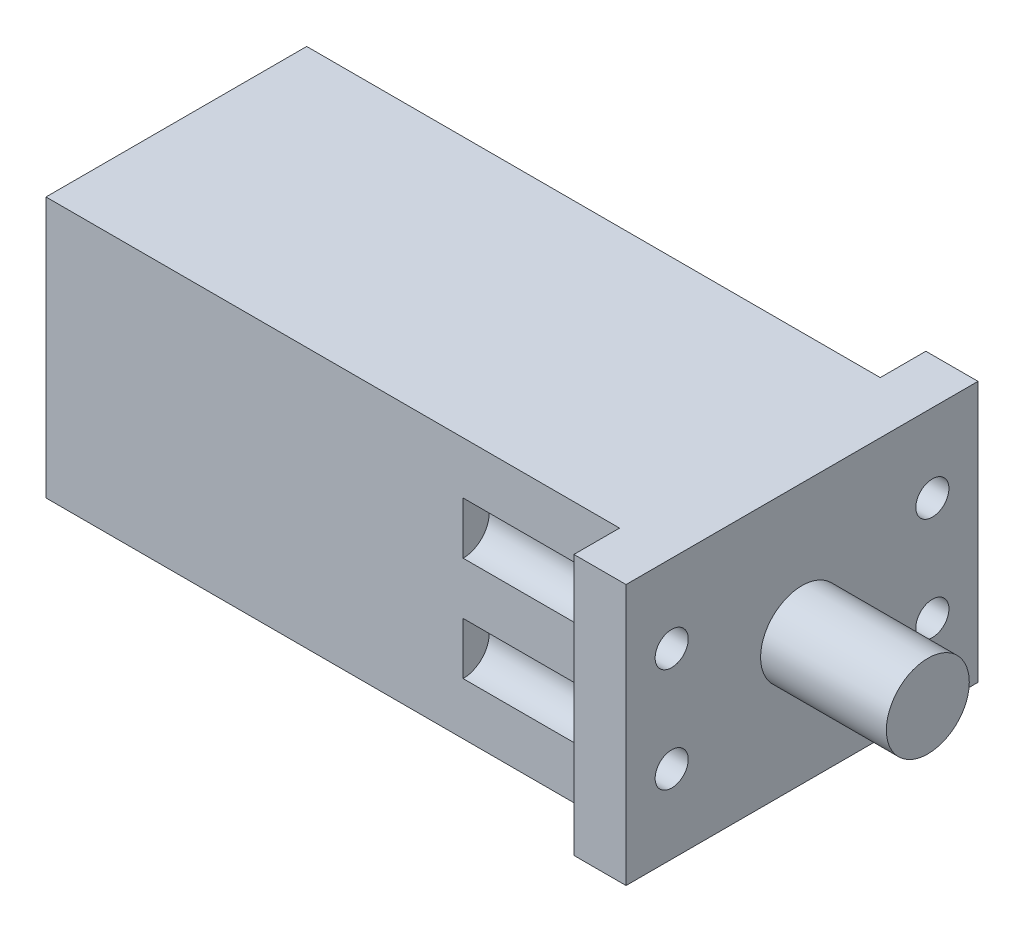
ISO-10303-21;
HEADER;
FILE_DESCRIPTION(('STEP AP214'),'2;1');
FILE_NAME('part.step','',(''),(''),'','','');
FILE_SCHEMA(('AUTOMOTIVE_DESIGN { 1 0 10303 214 1 1 1 1 }'));
ENDSEC;
DATA;
#1=APPLICATION_CONTEXT('core data for automotive mechanical design processes');
#2=APPLICATION_PROTOCOL_DEFINITION('international standard','automotive_design',2000,#1);
#3=PRODUCT_CONTEXT('',#1,'mechanical');
#4=PRODUCT('Part','Part','',(#3));
#5=PRODUCT_RELATED_PRODUCT_CATEGORY('part','',(#4));
#6=PRODUCT_DEFINITION_FORMATION('','',#4);
#7=PRODUCT_DEFINITION_CONTEXT('part definition',#1,'design');
#8=PRODUCT_DEFINITION('design','',#6,#7);
#9=PRODUCT_DEFINITION_SHAPE('','',#8);
#10=(LENGTH_UNIT() NAMED_UNIT(*) SI_UNIT(.MILLI.,.METRE.));
#11=(NAMED_UNIT(*) PLANE_ANGLE_UNIT() SI_UNIT($,.RADIAN.));
#12=(NAMED_UNIT(*) SI_UNIT($,.STERADIAN.) SOLID_ANGLE_UNIT());
#13=UNCERTAINTY_MEASURE_WITH_UNIT(LENGTH_MEASURE(1.E-05),#10,'distance_accuracy_value','');
#14=(GEOMETRIC_REPRESENTATION_CONTEXT(3) GLOBAL_UNCERTAINTY_ASSIGNED_CONTEXT((#13)) GLOBAL_UNIT_ASSIGNED_CONTEXT((#10,
#11,#12)) REPRESENTATION_CONTEXT('',''));
#15=CARTESIAN_POINT('',(0.,0.,0.));
#16=DIRECTION('',(0.,0.,1.));
#17=DIRECTION('',(1.,0.,0.));
#18=AXIS2_PLACEMENT_3D('',#15,#16,#17);
#19=CARTESIAN_POINT('',(240.,0.,-100.));
#20=DIRECTION('',(0.,0.,1.));
#21=DIRECTION('',(1.,0.,0.));
#22=AXIS2_PLACEMENT_3D('',#19,#20,#21);
#23=PLANE('',#22);
#24=DIRECTION('',(1.,0.,0.));
#25=VECTOR('',#24,1.);
#26=CARTESIAN_POINT('',(160.,20.,-100.));
#27=LINE('',#26,#25);
#28=CARTESIAN_POINT('',(220.,20.,-100.));
#29=VERTEX_POINT('',#28);
#30=CARTESIAN_POINT('',(160.,20.,-100.));
#31=VERTEX_POINT('',#30);
#32=EDGE_CURVE('E153',#29,#31,#27,.F.);
#33=ORIENTED_EDGE('',*,*,#32,.F.);
#34=DIRECTION('',(0.,1.,0.));
#35=VECTOR('',#34,1.);
#36=CARTESIAN_POINT('',(220.,0.,-100.));
#37=LINE('',#36,#35);
#38=CARTESIAN_POINT('',(220.,0.,-100.));
#39=VERTEX_POINT('',#38);
#40=EDGE_CURVE('E46',#39,#29,#37,.T.);
#41=ORIENTED_EDGE('',*,*,#40,.F.);
#42=DIRECTION('',(-1.,0.,0.));
#43=VECTOR('',#42,1.);
#44=CARTESIAN_POINT('',(240.,0.,-100.));
#45=LINE('',#44,#43);
#46=CARTESIAN_POINT('',(0.,0.,-100.));
#47=VERTEX_POINT('',#46);
#48=EDGE_CURVE('E324',#39,#47,#45,.T.);
#49=ORIENTED_EDGE('',*,*,#48,.T.);
#50=DIRECTION('',(0.,1.,0.));
#51=VECTOR('',#50,1.);
#52=CARTESIAN_POINT('',(0.,0.,-100.));
#53=LINE('',#52,#51);
#54=CARTESIAN_POINT('',(0.,100.,-100.));
#55=VERTEX_POINT('',#54);
#56=EDGE_CURVE('E330',#47,#55,#53,.T.);
#57=ORIENTED_EDGE('',*,*,#56,.T.);
#58=DIRECTION('',(-1.,0.,0.));
#59=VECTOR('',#58,1.);
#60=CARTESIAN_POINT('',(240.,100.,-100.));
#61=LINE('',#60,#59);
#62=CARTESIAN_POINT('',(220.,100.,-100.));
#63=VERTEX_POINT('',#62);
#64=EDGE_CURVE('E348',#63,#55,#61,.T.);
#65=ORIENTED_EDGE('',*,*,#64,.F.);
#66=CARTESIAN_POINT('',(220.,80.,-100.));
#67=VERTEX_POINT('',#66);
#68=EDGE_CURVE('E166',#67,#63,#37,.T.);
#69=ORIENTED_EDGE('',*,*,#68,.F.);
#70=DIRECTION('',(1.,0.,0.));
#71=VECTOR('',#70,1.);
#72=CARTESIAN_POINT('',(160.,80.,-100.));
#73=LINE('',#72,#71);
#74=CARTESIAN_POINT('',(160.,80.,-100.));
#75=VERTEX_POINT('',#74);
#76=EDGE_CURVE('E279',#75,#67,#73,.T.);
#77=ORIENTED_EDGE('',*,*,#76,.F.);
#78=DIRECTION('',(0.,-1.,0.));
#79=VECTOR('',#78,1.);
#80=CARTESIAN_POINT('',(160.,0.,-100.));
#81=LINE('',#80,#79);
#82=CARTESIAN_POINT('',(160.,60.,-100.));
#83=VERTEX_POINT('',#82);
#84=EDGE_CURVE('E39',#75,#83,#81,.T.);
#85=ORIENTED_EDGE('',*,*,#84,.T.);
#86=DIRECTION('',(1.,0.,0.));
#87=VECTOR('',#86,1.);
#88=CARTESIAN_POINT('',(160.,60.,-100.));
#89=LINE('',#88,#87);
#90=CARTESIAN_POINT('',(220.,60.,-100.));
#91=VERTEX_POINT('',#90);
#92=EDGE_CURVE('E165',#91,#83,#89,.F.);
#93=ORIENTED_EDGE('',*,*,#92,.F.);
#94=CARTESIAN_POINT('',(220.,40.,-100.));
#95=VERTEX_POINT('',#94);
#96=EDGE_CURVE('E159',#95,#91,#37,.T.);
#97=ORIENTED_EDGE('',*,*,#96,.F.);
#98=DIRECTION('',(1.,0.,0.));
#99=VECTOR('',#98,1.);
#100=CARTESIAN_POINT('',(160.,40.,-100.));
#101=LINE('',#100,#99);
#102=CARTESIAN_POINT('',(160.,40.,-100.));
#103=VERTEX_POINT('',#102);
#104=EDGE_CURVE('E146',#103,#95,#101,.T.);
#105=ORIENTED_EDGE('',*,*,#104,.F.);
#106=DIRECTION('',(0.,-1.,0.));
#107=VECTOR('',#106,1.);
#108=CARTESIAN_POINT('',(160.,0.,-100.));
#109=LINE('',#108,#107);
#110=EDGE_CURVE('E11',#103,#31,#109,.T.);
#111=ORIENTED_EDGE('',*,*,#110,.T.);
#112=EDGE_LOOP('',(#33,#41,#49,#57,#65,#69,#77,#85,#93,#97,#105,#111));
#113=FACE_BOUND('',#112,.T.);
#114=ADVANCED_FACE('F31',(#113),#23,.F.);
#115=CARTESIAN_POINT('',(240.,0.,0.));
#116=DIRECTION('',(0.,0.,-1.));
#117=DIRECTION('',(-1.,0.,0.));
#118=AXIS2_PLACEMENT_3D('',#115,#116,#117);
#119=PLANE('',#118);
#120=DIRECTION('',(1.,0.,0.));
#121=VECTOR('',#120,1.);
#122=CARTESIAN_POINT('',(160.,40.,0.));
#123=LINE('',#122,#121);
#124=CARTESIAN_POINT('',(220.,40.,0.));
#125=VERTEX_POINT('',#124);
#126=CARTESIAN_POINT('',(160.,40.,0.));
#127=VERTEX_POINT('',#126);
#128=EDGE_CURVE('E266',#125,#127,#123,.F.);
#129=ORIENTED_EDGE('',*,*,#128,.F.);
#130=DIRECTION('',(0.,-1.,0.));
#131=VECTOR('',#130,1.);
#132=CARTESIAN_POINT('',(220.,0.,0.));
#133=LINE('',#132,#131);
#134=CARTESIAN_POINT('',(220.,60.,0.));
#135=VERTEX_POINT('',#134);
#136=EDGE_CURVE('E192',#135,#125,#133,.T.);
#137=ORIENTED_EDGE('',*,*,#136,.F.);
#138=DIRECTION('',(1.,0.,0.));
#139=VECTOR('',#138,1.);
#140=CARTESIAN_POINT('',(160.,60.,0.));
#141=LINE('',#140,#139);
#142=CARTESIAN_POINT('',(160.,60.,0.));
#143=VERTEX_POINT('',#142);
#144=EDGE_CURVE('E260',#143,#135,#141,.T.);
#145=ORIENTED_EDGE('',*,*,#144,.F.);
#146=DIRECTION('',(0.,1.,0.));
#147=VECTOR('',#146,1.);
#148=CARTESIAN_POINT('',(160.,0.,0.));
#149=LINE('',#148,#147);
#150=CARTESIAN_POINT('',(160.,80.,0.));
#151=VERTEX_POINT('',#150);
#152=EDGE_CURVE('E188',#143,#151,#149,.T.);
#153=ORIENTED_EDGE('',*,*,#152,.T.);
#154=DIRECTION('',(1.,0.,0.));
#155=VECTOR('',#154,1.);
#156=CARTESIAN_POINT('',(160.,80.,0.));
#157=LINE('',#156,#155);
#158=CARTESIAN_POINT('',(220.,80.,0.));
#159=VERTEX_POINT('',#158);
#160=EDGE_CURVE('E258',#159,#151,#157,.F.);
#161=ORIENTED_EDGE('',*,*,#160,.F.);
#162=CARTESIAN_POINT('',(220.,100.,0.));
#163=VERTEX_POINT('',#162);
#164=EDGE_CURVE('E54',#163,#159,#133,.T.);
#165=ORIENTED_EDGE('',*,*,#164,.F.);
#166=DIRECTION('',(-1.,0.,0.));
#167=VECTOR('',#166,1.);
#168=CARTESIAN_POINT('',(240.,100.,0.));
#169=LINE('',#168,#167);
#170=CARTESIAN_POINT('',(0.,100.,0.));
#171=VERTEX_POINT('',#170);
#172=EDGE_CURVE('E346',#163,#171,#169,.T.);
#173=ORIENTED_EDGE('',*,*,#172,.T.);
#174=DIRECTION('',(0.,-1.,0.));
#175=VECTOR('',#174,1.);
#176=CARTESIAN_POINT('',(0.,0.,0.));
#177=LINE('',#176,#175);
#178=CARTESIAN_POINT('',(0.,0.,0.));
#179=VERTEX_POINT('',#178);
#180=EDGE_CURVE('E331',#171,#179,#177,.T.);
#181=ORIENTED_EDGE('',*,*,#180,.T.);
#182=DIRECTION('',(-1.,0.,0.));
#183=VECTOR('',#182,1.);
#184=CARTESIAN_POINT('',(240.,0.,0.));
#185=LINE('',#184,#183);
#186=CARTESIAN_POINT('',(220.,0.,0.));
#187=VERTEX_POINT('',#186);
#188=EDGE_CURVE('E218',#187,#179,#185,.T.);
#189=ORIENTED_EDGE('',*,*,#188,.F.);
#190=CARTESIAN_POINT('',(220.,20.,0.));
#191=VERTEX_POINT('',#190);
#192=EDGE_CURVE('E189',#191,#187,#133,.T.);
#193=ORIENTED_EDGE('',*,*,#192,.F.);
#194=DIRECTION('',(1.,0.,0.));
#195=VECTOR('',#194,1.);
#196=CARTESIAN_POINT('',(160.,20.,0.));
#197=LINE('',#196,#195);
#198=CARTESIAN_POINT('',(160.,20.,0.));
#199=VERTEX_POINT('',#198);
#200=EDGE_CURVE('E270',#199,#191,#197,.T.);
#201=ORIENTED_EDGE('',*,*,#200,.F.);
#202=DIRECTION('',(0.,1.,0.));
#203=VECTOR('',#202,1.);
#204=CARTESIAN_POINT('',(160.,0.,0.));
#205=LINE('',#204,#203);
#206=EDGE_CURVE('E185',#199,#127,#205,.T.);
#207=ORIENTED_EDGE('',*,*,#206,.T.);
#208=EDGE_LOOP('',(#129,#137,#145,#153,#161,#165,#173,#181,#189,#193,#201,#207));
#209=FACE_BOUND('',#208,.T.);
#210=ADVANCED_FACE('F33',(#209),#119,.F.);
#211=CARTESIAN_POINT('',(240.,100.,0.));
#212=DIRECTION('',(-1.,0.,0.));
#213=DIRECTION('',(0.,0.,1.));
#214=AXIS2_PLACEMENT_3D('',#211,#212,#213);
#215=PLANE('',#214);
#216=CARTESIAN_POINT('',(240.,70.,-100.));
#217=DIRECTION('',(1.,0.,0.));
#218=DIRECTION('',(0.,0.,-1.));
#219=AXIS2_PLACEMENT_3D('',#216,#217,#218);
#220=CIRCLE('',#219,6.34999999999999);
#221=CARTESIAN_POINT('',(240.,70.,-106.35));
#222=VERTEX_POINT('',#221);
#223=EDGE_CURVE('E255',#222,#222,#220,.T.);
#224=ORIENTED_EDGE('',*,*,#223,.F.);
#225=EDGE_LOOP('',(#224));
#226=FACE_BOUND('',#225,.T.);
#227=CARTESIAN_POINT('',(240.,30.,-100.));
#228=DIRECTION('',(1.,0.,0.));
#229=DIRECTION('',(0.,0.,-1.));
#230=AXIS2_PLACEMENT_3D('',#227,#228,#229);
#231=CIRCLE('',#230,6.35);
#232=CARTESIAN_POINT('',(240.,30.,-106.35));
#233=VERTEX_POINT('',#232);
#234=EDGE_CURVE('E250',#233,#233,#231,.T.);
#235=ORIENTED_EDGE('',*,*,#234,.F.);
#236=EDGE_LOOP('',(#235));
#237=FACE_BOUND('',#236,.T.);
#238=CARTESIAN_POINT('',(240.,30.,0.));
#239=DIRECTION('',(1.,0.,0.));
#240=DIRECTION('',(0.,0.,-1.));
#241=AXIS2_PLACEMENT_3D('',#238,#239,#240);
#242=CIRCLE('',#241,6.35);
#243=CARTESIAN_POINT('',(240.,30.,-6.35));
#244=VERTEX_POINT('',#243);
#245=EDGE_CURVE('E247',#244,#244,#242,.T.);
#246=ORIENTED_EDGE('',*,*,#245,.F.);
#247=EDGE_LOOP('',(#246));
#248=FACE_BOUND('',#247,.T.);
#249=CARTESIAN_POINT('',(240.,70.,0.));
#250=DIRECTION('',(1.,0.,0.));
#251=DIRECTION('',(0.,0.,-1.));
#252=AXIS2_PLACEMENT_3D('',#249,#250,#251);
#253=CIRCLE('',#252,6.35);
#254=CARTESIAN_POINT('',(240.,70.,-6.34999999999999));
#255=VERTEX_POINT('',#254);
#256=EDGE_CURVE('E241',#255,#255,#253,.T.);
#257=ORIENTED_EDGE('',*,*,#256,.F.);
#258=EDGE_LOOP('',(#257));
#259=FACE_BOUND('',#258,.T.);
#260=DIRECTION('',(0.,0.,1.));
#261=VECTOR('',#260,1.);
#262=CARTESIAN_POINT('',(240.,100.,0.));
#263=LINE('',#262,#261);
#264=CARTESIAN_POINT('',(240.,100.,-117.5));
#265=VERTEX_POINT('',#264);
#266=CARTESIAN_POINT('',(240.,100.,17.5));
#267=VERTEX_POINT('',#266);
#268=EDGE_CURVE('E349',#265,#267,#263,.T.);
#269=ORIENTED_EDGE('',*,*,#268,.T.);
#270=DIRECTION('',(0.,1.,0.));
#271=VECTOR('',#270,1.);
#272=CARTESIAN_POINT('',(240.,0.,17.5));
#273=LINE('',#272,#271);
#274=CARTESIAN_POINT('',(240.,0.,17.5));
#275=VERTEX_POINT('',#274);
#276=EDGE_CURVE('E178',#275,#267,#273,.T.);
#277=ORIENTED_EDGE('',*,*,#276,.F.);
#278=DIRECTION('',(0.,0.,-1.));
#279=VECTOR('',#278,1.);
#280=CARTESIAN_POINT('',(240.,0.,0.));
#281=LINE('',#280,#279);
#282=CARTESIAN_POINT('',(240.,0.,-117.5));
#283=VERTEX_POINT('',#282);
#284=EDGE_CURVE('E200',#275,#283,#281,.T.);
#285=ORIENTED_EDGE('',*,*,#284,.T.);
#286=DIRECTION('',(0.,-1.,0.));
#287=VECTOR('',#286,1.);
#288=CARTESIAN_POINT('',(240.,0.,-117.5));
#289=LINE('',#288,#287);
#290=EDGE_CURVE('E167',#265,#283,#289,.T.);
#291=ORIENTED_EDGE('',*,*,#290,.F.);
#292=EDGE_LOOP('',(#269,#277,#285,#291));
#293=FACE_BOUND('',#292,.T.);
#294=CARTESIAN_POINT('',(240.,50.,-50.));
#295=DIRECTION('',(-1.,0.,0.));
#296=DIRECTION('',(0.,0.,1.));
#297=AXIS2_PLACEMENT_3D('',#294,#295,#296);
#298=CIRCLE('',#297,15.9);
#299=CARTESIAN_POINT('',(240.,50.,-34.1));
#300=VERTEX_POINT('',#299);
#301=EDGE_CURVE('E215',#300,#300,#298,.F.);
#302=ORIENTED_EDGE('',*,*,#301,.F.);
#303=EDGE_LOOP('',(#302));
#304=FACE_BOUND('',#303,.T.);
#305=ADVANCED_FACE('F306',(#226,#237,#248,#259,#293,#304),#215,.F.);
#306=CARTESIAN_POINT('',(240.,0.,0.));
#307=DIRECTION('',(0.,1.,0.));
#308=DIRECTION('',(0.,0.,1.));
#309=AXIS2_PLACEMENT_3D('',#306,#307,#308);
#310=PLANE('',#309);
#311=DIRECTION('',(0.,0.,-1.));
#312=VECTOR('',#311,1.);
#313=CARTESIAN_POINT('',(0.,0.,0.));
#314=LINE('',#313,#312);
#315=EDGE_CURVE('E321',#179,#47,#314,.T.);
#316=ORIENTED_EDGE('',*,*,#315,.T.);
#317=ORIENTED_EDGE('',*,*,#48,.F.);
#318=DIRECTION('',(0.,0.,1.));
#319=VECTOR('',#318,1.);
#320=CARTESIAN_POINT('',(220.,0.,-117.5));
#321=LINE('',#320,#319);
#322=CARTESIAN_POINT('',(220.,0.,-117.5));
#323=VERTEX_POINT('',#322);
#324=EDGE_CURVE('E193',#323,#39,#321,.T.);
#325=ORIENTED_EDGE('',*,*,#324,.F.);
#326=DIRECTION('',(-1.,0.,0.));
#327=VECTOR('',#326,1.);
#328=CARTESIAN_POINT('',(240.,0.,-117.5));
#329=LINE('',#328,#327);
#330=EDGE_CURVE('E233',#283,#323,#329,.T.);
#331=ORIENTED_EDGE('',*,*,#330,.F.);
#332=ORIENTED_EDGE('',*,*,#284,.F.);
#333=DIRECTION('',(1.,0.,0.));
#334=VECTOR('',#333,1.);
#335=CARTESIAN_POINT('',(240.,0.,17.5));
#336=LINE('',#335,#334);
#337=CARTESIAN_POINT('',(220.,0.,17.5));
#338=VERTEX_POINT('',#337);
#339=EDGE_CURVE('E198',#338,#275,#336,.T.);
#340=ORIENTED_EDGE('',*,*,#339,.F.);
#341=DIRECTION('',(0.,0.,-1.));
#342=VECTOR('',#341,1.);
#343=CARTESIAN_POINT('',(220.,0.,17.5));
#344=LINE('',#343,#342);
#345=EDGE_CURVE('E360',#338,#187,#344,.T.);
#346=ORIENTED_EDGE('',*,*,#345,.T.);
#347=ORIENTED_EDGE('',*,*,#188,.T.);
#348=EDGE_LOOP('',(#316,#317,#325,#331,#332,#340,#346,#347));
#349=FACE_BOUND('',#348,.T.);
#350=ADVANCED_FACE('F310',(#349),#310,.F.);
#351=CARTESIAN_POINT('',(240.,100.,0.));
#352=DIRECTION('',(0.,-1.,0.));
#353=DIRECTION('',(0.,0.,-1.));
#354=AXIS2_PLACEMENT_3D('',#351,#352,#353);
#355=PLANE('',#354);
#356=DIRECTION('',(0.,0.,1.));
#357=VECTOR('',#356,1.);
#358=CARTESIAN_POINT('',(0.,100.,0.));
#359=LINE('',#358,#357);
#360=EDGE_CURVE('E336',#55,#171,#359,.T.);
#361=ORIENTED_EDGE('',*,*,#360,.T.);
#362=ORIENTED_EDGE('',*,*,#172,.F.);
#363=DIRECTION('',(0.,0.,-1.));
#364=VECTOR('',#363,1.);
#365=CARTESIAN_POINT('',(220.,100.,17.5));
#366=LINE('',#365,#364);
#367=CARTESIAN_POINT('',(220.,100.,17.5));
#368=VERTEX_POINT('',#367);
#369=EDGE_CURVE('E357',#368,#163,#366,.T.);
#370=ORIENTED_EDGE('',*,*,#369,.F.);
#371=DIRECTION('',(-1.,0.,0.));
#372=VECTOR('',#371,1.);
#373=CARTESIAN_POINT('',(240.,100.,17.5));
#374=LINE('',#373,#372);
#375=EDGE_CURVE('E369',#267,#368,#374,.T.);
#376=ORIENTED_EDGE('',*,*,#375,.F.);
#377=ORIENTED_EDGE('',*,*,#268,.F.);
#378=DIRECTION('',(1.,0.,0.));
#379=VECTOR('',#378,1.);
#380=CARTESIAN_POINT('',(240.,100.,-117.5));
#381=LINE('',#380,#379);
#382=CARTESIAN_POINT('',(220.,100.,-117.5));
#383=VERTEX_POINT('',#382);
#384=EDGE_CURVE('E176',#383,#265,#381,.T.);
#385=ORIENTED_EDGE('',*,*,#384,.F.);
#386=DIRECTION('',(0.,0.,1.));
#387=VECTOR('',#386,1.);
#388=CARTESIAN_POINT('',(220.,100.,-117.5));
#389=LINE('',#388,#387);
#390=EDGE_CURVE('E222',#383,#63,#389,.T.);
#391=ORIENTED_EDGE('',*,*,#390,.T.);
#392=ORIENTED_EDGE('',*,*,#64,.T.);
#393=EDGE_LOOP('',(#361,#362,#370,#376,#377,#385,#391,#392));
#394=FACE_BOUND('',#393,.T.);
#395=ADVANCED_FACE('F308',(#394),#355,.F.);
#396=CARTESIAN_POINT('',(0.,100.,0.));
#397=DIRECTION('',(-1.,0.,0.));
#398=DIRECTION('',(0.,0.,1.));
#399=AXIS2_PLACEMENT_3D('',#396,#397,#398);
#400=PLANE('',#399);
#401=ORIENTED_EDGE('',*,*,#180,.F.);
#402=ORIENTED_EDGE('',*,*,#360,.F.);
#403=ORIENTED_EDGE('',*,*,#56,.F.);
#404=ORIENTED_EDGE('',*,*,#315,.F.);
#405=EDGE_LOOP('',(#401,#402,#403,#404));
#406=FACE_BOUND('',#405,.T.);
#407=ADVANCED_FACE('F316',(#406),#400,.T.);
#408=CARTESIAN_POINT('',(220.,0.,17.5));
#409=DIRECTION('',(1.,0.,0.));
#410=DIRECTION('',(0.,0.,-1.));
#411=AXIS2_PLACEMENT_3D('',#408,#409,#410);
#412=PLANE('',#411);
#413=CARTESIAN_POINT('',(220.,30.,0.));
#414=DIRECTION('',(-1.,0.,0.));
#415=DIRECTION('',(0.,0.,1.));
#416=AXIS2_PLACEMENT_3D('',#413,#414,#415);
#417=CIRCLE('',#416,10.);
#418=EDGE_CURVE('E273',#125,#191,#417,.T.);
#419=ORIENTED_EDGE('',*,*,#418,.T.);
#420=ORIENTED_EDGE('',*,*,#192,.T.);
#421=ORIENTED_EDGE('',*,*,#345,.F.);
#422=DIRECTION('',(0.,-1.,0.));
#423=VECTOR('',#422,1.);
#424=CARTESIAN_POINT('',(220.,0.,17.5));
#425=LINE('',#424,#423);
#426=EDGE_CURVE('E365',#368,#338,#425,.T.);
#427=ORIENTED_EDGE('',*,*,#426,.F.);
#428=ORIENTED_EDGE('',*,*,#369,.T.);
#429=ORIENTED_EDGE('',*,*,#164,.T.);
#430=CARTESIAN_POINT('',(220.,70.,0.));
#431=DIRECTION('',(-1.,0.,0.));
#432=DIRECTION('',(0.,0.,1.));
#433=AXIS2_PLACEMENT_3D('',#430,#431,#432);
#434=CIRCLE('',#433,10.);
#435=EDGE_CURVE('E263',#159,#135,#434,.T.);
#436=ORIENTED_EDGE('',*,*,#435,.T.);
#437=ORIENTED_EDGE('',*,*,#136,.T.);
#438=EDGE_LOOP('',(#419,#420,#421,#427,#428,#429,#436,#437));
#439=FACE_BOUND('',#438,.T.);
#440=CARTESIAN_POINT('',(220.,30.,0.));
#441=DIRECTION('',(1.,0.,0.));
#442=DIRECTION('',(0.,0.,-1.));
#443=AXIS2_PLACEMENT_3D('',#440,#441,#442);
#444=CIRCLE('',#443,6.35);
#445=CARTESIAN_POINT('',(220.,30.,-6.35));
#446=VERTEX_POINT('',#445);
#447=EDGE_CURVE('E244',#446,#446,#444,.T.);
#448=ORIENTED_EDGE('',*,*,#447,.T.);
#449=EDGE_LOOP('',(#448));
#450=FACE_BOUND('',#449,.T.);
#451=CARTESIAN_POINT('',(220.,70.,0.));
#452=DIRECTION('',(1.,0.,0.));
#453=DIRECTION('',(0.,0.,-1.));
#454=AXIS2_PLACEMENT_3D('',#451,#452,#453);
#455=CIRCLE('',#454,6.35);
#456=CARTESIAN_POINT('',(220.,70.,-6.34999999999999));
#457=VERTEX_POINT('',#456);
#458=EDGE_CURVE('E240',#457,#457,#455,.T.);
#459=ORIENTED_EDGE('',*,*,#458,.T.);
#460=EDGE_LOOP('',(#459));
#461=FACE_BOUND('',#460,.T.);
#462=ADVANCED_FACE('F374',(#439,#450,#461),#412,.F.);
#463=CARTESIAN_POINT('',(240.,100.,17.5));
#464=DIRECTION('',(0.,0.,1.));
#465=DIRECTION('',(1.,0.,0.));
#466=AXIS2_PLACEMENT_3D('',#463,#464,#465);
#467=PLANE('',#466);
#468=ORIENTED_EDGE('',*,*,#276,.T.);
#469=ORIENTED_EDGE('',*,*,#375,.T.);
#470=ORIENTED_EDGE('',*,*,#426,.T.);
#471=ORIENTED_EDGE('',*,*,#339,.T.);
#472=EDGE_LOOP('',(#468,#469,#470,#471));
#473=FACE_BOUND('',#472,.T.);
#474=ADVANCED_FACE('F395',(#473),#467,.T.);
#475=CARTESIAN_POINT('',(220.,0.,-117.5));
#476=DIRECTION('',(1.,0.,0.));
#477=DIRECTION('',(0.,0.,-1.));
#478=AXIS2_PLACEMENT_3D('',#475,#476,#477);
#479=PLANE('',#478);
#480=CARTESIAN_POINT('',(220.,30.,-100.));
#481=DIRECTION('',(-1.,0.,0.));
#482=DIRECTION('',(0.,0.,1.));
#483=AXIS2_PLACEMENT_3D('',#480,#481,#482);
#484=CIRCLE('',#483,9.99999999999999);
#485=EDGE_CURVE('E149',#29,#95,#484,.T.);
#486=ORIENTED_EDGE('',*,*,#485,.T.);
#487=ORIENTED_EDGE('',*,*,#96,.T.);
#488=CARTESIAN_POINT('',(220.,70.,-100.));
#489=DIRECTION('',(-1.,0.,0.));
#490=DIRECTION('',(0.,0.,1.));
#491=AXIS2_PLACEMENT_3D('',#488,#489,#490);
#492=CIRCLE('',#491,9.99999999999999);
#493=EDGE_CURVE('E282',#91,#67,#492,.T.);
#494=ORIENTED_EDGE('',*,*,#493,.T.);
#495=ORIENTED_EDGE('',*,*,#68,.T.);
#496=ORIENTED_EDGE('',*,*,#390,.F.);
#497=DIRECTION('',(0.,1.,0.));
#498=VECTOR('',#497,1.);
#499=CARTESIAN_POINT('',(220.,0.,-117.5));
#500=LINE('',#499,#498);
#501=EDGE_CURVE('E229',#323,#383,#500,.T.);
#502=ORIENTED_EDGE('',*,*,#501,.F.);
#503=ORIENTED_EDGE('',*,*,#324,.T.);
#504=ORIENTED_EDGE('',*,*,#40,.T.);
#505=EDGE_LOOP('',(#486,#487,#494,#495,#496,#502,#503,#504));
#506=FACE_BOUND('',#505,.T.);
#507=CARTESIAN_POINT('',(220.,30.,-100.));
#508=DIRECTION('',(1.,0.,0.));
#509=DIRECTION('',(0.,0.,-1.));
#510=AXIS2_PLACEMENT_3D('',#507,#508,#509);
#511=CIRCLE('',#510,6.35);
#512=CARTESIAN_POINT('',(220.,30.,-106.35));
#513=VERTEX_POINT('',#512);
#514=EDGE_CURVE('E212',#513,#513,#511,.T.);
#515=ORIENTED_EDGE('',*,*,#514,.T.);
#516=EDGE_LOOP('',(#515));
#517=FACE_BOUND('',#516,.T.);
#518=CARTESIAN_POINT('',(220.,70.,-100.));
#519=DIRECTION('',(1.,0.,0.));
#520=DIRECTION('',(0.,0.,-1.));
#521=AXIS2_PLACEMENT_3D('',#518,#519,#520);
#522=CIRCLE('',#521,6.34999999999999);
#523=CARTESIAN_POINT('',(220.,70.,-106.35));
#524=VERTEX_POINT('',#523);
#525=EDGE_CURVE('E209',#524,#524,#522,.T.);
#526=ORIENTED_EDGE('',*,*,#525,.T.);
#527=EDGE_LOOP('',(#526));
#528=FACE_BOUND('',#527,.T.);
#529=ADVANCED_FACE('F156',(#506,#517,#528),#479,.F.);
#530=CARTESIAN_POINT('',(240.,100.,-117.5));
#531=DIRECTION('',(0.,0.,1.));
#532=DIRECTION('',(1.,0.,0.));
#533=AXIS2_PLACEMENT_3D('',#530,#531,#532);
#534=PLANE('',#533);
#535=ORIENTED_EDGE('',*,*,#290,.T.);
#536=ORIENTED_EDGE('',*,*,#330,.T.);
#537=ORIENTED_EDGE('',*,*,#501,.T.);
#538=ORIENTED_EDGE('',*,*,#384,.T.);
#539=EDGE_LOOP('',(#535,#536,#537,#538));
#540=FACE_BOUND('',#539,.T.);
#541=ADVANCED_FACE('F382',(#540),#534,.F.);
#542=CARTESIAN_POINT('',(288.26,50.,-50.));
#543=DIRECTION('',(-1.,0.,0.));
#544=DIRECTION('',(0.,0.,1.));
#545=AXIS2_PLACEMENT_3D('',#542,#543,#544);
#546=CYLINDRICAL_SURFACE('',#545,15.9);
#547=CARTESIAN_POINT('',(288.26,50.,-50.));
#548=DIRECTION('',(1.,0.,0.));
#549=DIRECTION('',(0.,0.,-1.));
#550=AXIS2_PLACEMENT_3D('',#547,#548,#549);
#551=CIRCLE('',#550,15.9);
#552=CARTESIAN_POINT('',(288.26,50.,-65.9));
#553=VERTEX_POINT('',#552);
#554=EDGE_CURVE('E169',#553,#553,#551,.T.);
#555=ORIENTED_EDGE('',*,*,#554,.F.);
#556=EDGE_LOOP('',(#555));
#557=FACE_BOUND('',#556,.T.);
#558=ORIENTED_EDGE('',*,*,#301,.T.);
#559=EDGE_LOOP('',(#558));
#560=FACE_BOUND('',#559,.T.);
#561=ADVANCED_FACE('F384',(#557,#560),#546,.T.);
#562=CARTESIAN_POINT('',(288.26,50.,-180.817069431921));
#563=DIRECTION('',(1.,0.,0.));
#564=DIRECTION('',(0.,0.,-1.));
#565=AXIS2_PLACEMENT_3D('',#562,#563,#564);
#566=PLANE('',#565);
#567=ORIENTED_EDGE('',*,*,#554,.T.);
#568=EDGE_LOOP('',(#567));
#569=FACE_BOUND('',#568,.T.);
#570=ADVANCED_FACE('F391',(#569),#566,.T.);
#571=CARTESIAN_POINT('',(220.,70.,0.));
#572=DIRECTION('',(1.,0.,0.));
#573=DIRECTION('',(0.,0.,-1.));
#574=AXIS2_PLACEMENT_3D('',#571,#572,#573);
#575=CYLINDRICAL_SURFACE('',#574,6.35);
#576=ORIENTED_EDGE('',*,*,#458,.F.);
#577=EDGE_LOOP('',(#576));
#578=FACE_BOUND('',#577,.T.);
#579=ORIENTED_EDGE('',*,*,#256,.T.);
#580=EDGE_LOOP('',(#579));
#581=FACE_BOUND('',#580,.T.);
#582=ADVANCED_FACE('F443',(#578,#581),#575,.F.);
#583=CARTESIAN_POINT('',(220.,30.,0.));
#584=DIRECTION('',(1.,0.,0.));
#585=DIRECTION('',(0.,0.,-1.));
#586=AXIS2_PLACEMENT_3D('',#583,#584,#585);
#587=CYLINDRICAL_SURFACE('',#586,6.35);
#588=ORIENTED_EDGE('',*,*,#447,.F.);
#589=EDGE_LOOP('',(#588));
#590=FACE_BOUND('',#589,.T.);
#591=ORIENTED_EDGE('',*,*,#245,.T.);
#592=EDGE_LOOP('',(#591));
#593=FACE_BOUND('',#592,.T.);
#594=ADVANCED_FACE('F481',(#590,#593),#587,.F.);
#595=CARTESIAN_POINT('',(220.,30.,-100.));
#596=DIRECTION('',(1.,0.,0.));
#597=DIRECTION('',(0.,0.,-1.));
#598=AXIS2_PLACEMENT_3D('',#595,#596,#597);
#599=CYLINDRICAL_SURFACE('',#598,6.35);
#600=ORIENTED_EDGE('',*,*,#514,.F.);
#601=EDGE_LOOP('',(#600));
#602=FACE_BOUND('',#601,.T.);
#603=ORIENTED_EDGE('',*,*,#234,.T.);
#604=EDGE_LOOP('',(#603));
#605=FACE_BOUND('',#604,.T.);
#606=ADVANCED_FACE('F488',(#602,#605),#599,.F.);
#607=CARTESIAN_POINT('',(220.,70.,-100.));
#608=DIRECTION('',(1.,0.,0.));
#609=DIRECTION('',(0.,0.,-1.));
#610=AXIS2_PLACEMENT_3D('',#607,#608,#609);
#611=CYLINDRICAL_SURFACE('',#610,6.34999999999999);
#612=ORIENTED_EDGE('',*,*,#525,.F.);
#613=EDGE_LOOP('',(#612));
#614=FACE_BOUND('',#613,.T.);
#615=ORIENTED_EDGE('',*,*,#223,.T.);
#616=EDGE_LOOP('',(#615));
#617=FACE_BOUND('',#616,.T.);
#618=ADVANCED_FACE('F496',(#614,#617),#611,.F.);
#619=CARTESIAN_POINT('',(160.,70.,0.));
#620=DIRECTION('',(-1.,0.,0.));
#621=DIRECTION('',(0.,0.,1.));
#622=AXIS2_PLACEMENT_3D('',#619,#620,#621);
#623=PLANE('',#622);
#624=CARTESIAN_POINT('',(160.,70.,0.));
#625=DIRECTION('',(-1.,0.,0.));
#626=DIRECTION('',(0.,0.,1.));
#627=AXIS2_PLACEMENT_3D('',#624,#625,#626);
#628=CIRCLE('',#627,10.);
#629=EDGE_CURVE('E262',#151,#143,#628,.T.);
#630=ORIENTED_EDGE('',*,*,#629,.F.);
#631=ORIENTED_EDGE('',*,*,#152,.F.);
#632=EDGE_LOOP('',(#630,#631));
#633=FACE_BOUND('',#632,.T.);
#634=ADVANCED_FACE('F504',(#633),#623,.F.);
#635=CARTESIAN_POINT('',(160.,70.,0.));
#636=DIRECTION('',(1.,0.,0.));
#637=DIRECTION('',(0.,0.,-1.));
#638=AXIS2_PLACEMENT_3D('',#635,#636,#637);
#639=CYLINDRICAL_SURFACE('',#638,10.);
#640=ORIENTED_EDGE('',*,*,#160,.T.);
#641=ORIENTED_EDGE('',*,*,#629,.T.);
#642=ORIENTED_EDGE('',*,*,#144,.T.);
#643=ORIENTED_EDGE('',*,*,#435,.F.);
#644=EDGE_LOOP('',(#640,#641,#642,#643));
#645=FACE_BOUND('',#644,.T.);
#646=ADVANCED_FACE('F511',(#645),#639,.F.);
#647=CARTESIAN_POINT('',(160.,30.,0.));
#648=DIRECTION('',(-1.,0.,0.));
#649=DIRECTION('',(0.,0.,1.));
#650=AXIS2_PLACEMENT_3D('',#647,#648,#649);
#651=PLANE('',#650);
#652=CARTESIAN_POINT('',(160.,30.,0.));
#653=DIRECTION('',(-1.,0.,0.));
#654=DIRECTION('',(0.,0.,1.));
#655=AXIS2_PLACEMENT_3D('',#652,#653,#654);
#656=CIRCLE('',#655,10.);
#657=EDGE_CURVE('E272',#127,#199,#656,.T.);
#658=ORIENTED_EDGE('',*,*,#657,.F.);
#659=ORIENTED_EDGE('',*,*,#206,.F.);
#660=EDGE_LOOP('',(#658,#659));
#661=FACE_BOUND('',#660,.T.);
#662=ADVANCED_FACE('F519',(#661),#651,.F.);
#663=CARTESIAN_POINT('',(160.,30.,0.));
#664=DIRECTION('',(1.,0.,0.));
#665=DIRECTION('',(0.,0.,-1.));
#666=AXIS2_PLACEMENT_3D('',#663,#664,#665);
#667=CYLINDRICAL_SURFACE('',#666,10.);
#668=ORIENTED_EDGE('',*,*,#128,.T.);
#669=ORIENTED_EDGE('',*,*,#657,.T.);
#670=ORIENTED_EDGE('',*,*,#200,.T.);
#671=ORIENTED_EDGE('',*,*,#418,.F.);
#672=EDGE_LOOP('',(#668,#669,#670,#671));
#673=FACE_BOUND('',#672,.T.);
#674=ADVANCED_FACE('F527',(#673),#667,.F.);
#675=CARTESIAN_POINT('',(160.,70.,-100.));
#676=DIRECTION('',(-1.,0.,0.));
#677=DIRECTION('',(0.,0.,1.));
#678=AXIS2_PLACEMENT_3D('',#675,#676,#677);
#679=PLANE('',#678);
#680=CARTESIAN_POINT('',(160.,70.,-100.));
#681=DIRECTION('',(-1.,0.,0.));
#682=DIRECTION('',(0.,0.,1.));
#683=AXIS2_PLACEMENT_3D('',#680,#681,#682);
#684=CIRCLE('',#683,9.99999999999999);
#685=EDGE_CURVE('E281',#83,#75,#684,.T.);
#686=ORIENTED_EDGE('',*,*,#685,.F.);
#687=ORIENTED_EDGE('',*,*,#84,.F.);
#688=EDGE_LOOP('',(#686,#687));
#689=FACE_BOUND('',#688,.T.);
#690=ADVANCED_FACE('F297',(#689),#679,.F.);
#691=CARTESIAN_POINT('',(160.,70.,-100.));
#692=DIRECTION('',(1.,0.,0.));
#693=DIRECTION('',(0.,0.,-1.));
#694=AXIS2_PLACEMENT_3D('',#691,#692,#693);
#695=CYLINDRICAL_SURFACE('',#694,9.99999999999999);
#696=ORIENTED_EDGE('',*,*,#92,.T.);
#697=ORIENTED_EDGE('',*,*,#685,.T.);
#698=ORIENTED_EDGE('',*,*,#76,.T.);
#699=ORIENTED_EDGE('',*,*,#493,.F.);
#700=EDGE_LOOP('',(#696,#697,#698,#699));
#701=FACE_BOUND('',#700,.T.);
#702=ADVANCED_FACE('F290',(#701),#695,.F.);
#703=CARTESIAN_POINT('',(160.,30.,-100.));
#704=DIRECTION('',(-1.,0.,0.));
#705=DIRECTION('',(0.,0.,1.));
#706=AXIS2_PLACEMENT_3D('',#703,#704,#705);
#707=PLANE('',#706);
#708=CARTESIAN_POINT('',(160.,30.,-100.));
#709=DIRECTION('',(-1.,0.,0.));
#710=DIRECTION('',(0.,0.,1.));
#711=AXIS2_PLACEMENT_3D('',#708,#709,#710);
#712=CIRCLE('',#711,9.99999999999999);
#713=EDGE_CURVE('E151',#31,#103,#712,.T.);
#714=ORIENTED_EDGE('',*,*,#713,.F.);
#715=ORIENTED_EDGE('',*,*,#110,.F.);
#716=EDGE_LOOP('',(#714,#715));
#717=FACE_BOUND('',#716,.T.);
#718=ADVANCED_FACE('F288',(#717),#707,.F.);
#719=CARTESIAN_POINT('',(160.,30.,-100.));
#720=DIRECTION('',(1.,0.,0.));
#721=DIRECTION('',(0.,0.,-1.));
#722=AXIS2_PLACEMENT_3D('',#719,#720,#721);
#723=CYLINDRICAL_SURFACE('',#722,9.99999999999999);
#724=ORIENTED_EDGE('',*,*,#32,.T.);
#725=ORIENTED_EDGE('',*,*,#713,.T.);
#726=ORIENTED_EDGE('',*,*,#104,.T.);
#727=ORIENTED_EDGE('',*,*,#485,.F.);
#728=EDGE_LOOP('',(#724,#725,#726,#727));
#729=FACE_BOUND('',#728,.T.);
#730=ADVANCED_FACE('F148',(#729),#723,.F.);
#731=CLOSED_SHELL('',(#114,#210,#305,#350,#395,#407,#462,#474,#529,#541,#561,#570,#582,#594,
#606,#618,#634,#646,#662,#674,#690,#702,#718,#730));
#732=MANIFOLD_SOLID_BREP('B2',#731);
#733=ADVANCED_BREP_SHAPE_REPRESENTATION('',(#18,#732),#14);
#734=SHAPE_DEFINITION_REPRESENTATION(#9,#733);
ENDSEC;
END-ISO-10303-21;
